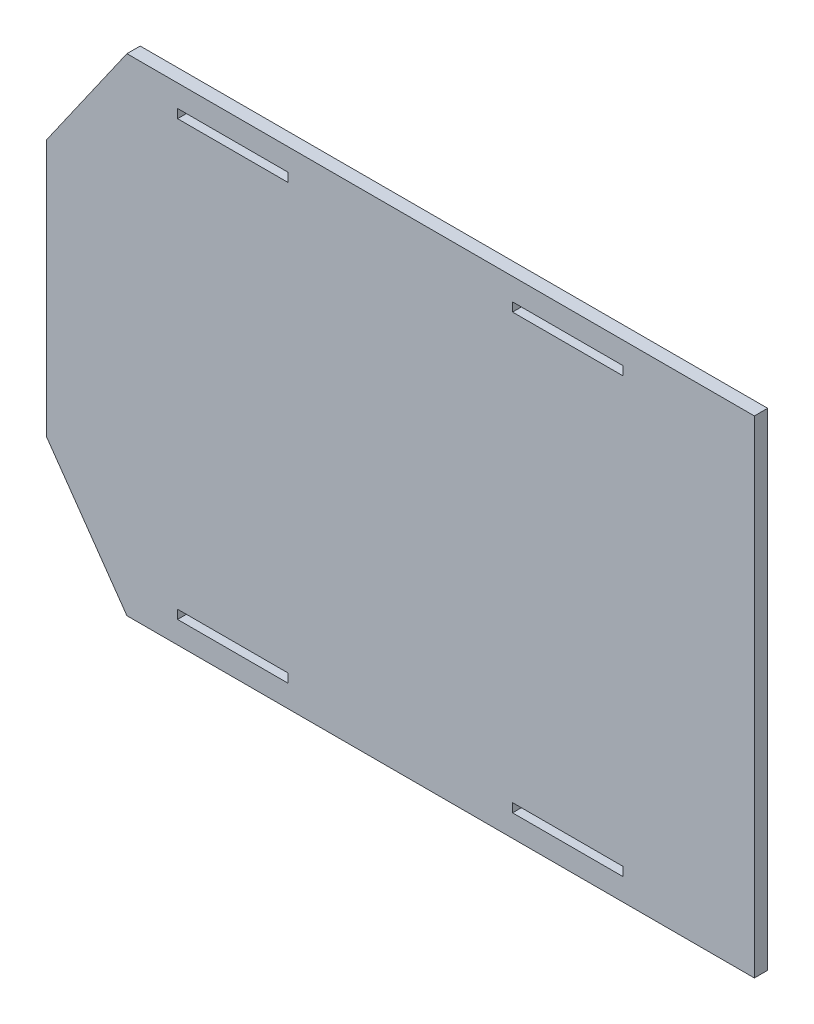
ISO-10303-21;
HEADER;
FILE_DESCRIPTION(('STEP AP214'),'2;1');
FILE_NAME('part.step','',(''),(''),'','','');
FILE_SCHEMA(('AUTOMOTIVE_DESIGN { 1 0 10303 214 1 1 1 1 }'));
ENDSEC;
DATA;
#1=APPLICATION_CONTEXT('core data for automotive mechanical design processes');
#2=APPLICATION_PROTOCOL_DEFINITION('international standard','automotive_design',2000,#1);
#3=PRODUCT_CONTEXT('',#1,'mechanical');
#4=PRODUCT('Part','Part','',(#3));
#5=PRODUCT_RELATED_PRODUCT_CATEGORY('part','',(#4));
#6=PRODUCT_DEFINITION_FORMATION('','',#4);
#7=PRODUCT_DEFINITION_CONTEXT('part definition',#1,'design');
#8=PRODUCT_DEFINITION('design','',#6,#7);
#9=PRODUCT_DEFINITION_SHAPE('','',#8);
#10=(LENGTH_UNIT() NAMED_UNIT(*) SI_UNIT(.MILLI.,.METRE.));
#11=(NAMED_UNIT(*) PLANE_ANGLE_UNIT() SI_UNIT($,.RADIAN.));
#12=(NAMED_UNIT(*) SI_UNIT($,.STERADIAN.) SOLID_ANGLE_UNIT());
#13=UNCERTAINTY_MEASURE_WITH_UNIT(LENGTH_MEASURE(1.E-05),#10,'distance_accuracy_value','');
#14=(GEOMETRIC_REPRESENTATION_CONTEXT(3) GLOBAL_UNCERTAINTY_ASSIGNED_CONTEXT((#13)) GLOBAL_UNIT_ASSIGNED_CONTEXT((#10,
#11,#12)) REPRESENTATION_CONTEXT('',''));
#15=CARTESIAN_POINT('',(0.,0.,0.));
#16=DIRECTION('',(0.,0.,1.));
#17=DIRECTION('',(1.,0.,0.));
#18=AXIS2_PLACEMENT_3D('',#15,#16,#17);
#19=CARTESIAN_POINT('',(0.,0.,6.));
#20=DIRECTION('',(0.,0.,-1.));
#21=DIRECTION('',(-1.,0.,0.));
#22=AXIS2_PLACEMENT_3D('',#19,#20,#21);
#23=PLANE('',#22);
#24=DIRECTION('',(0.,1.,0.));
#25=VECTOR('',#24,1.);
#26=CARTESIAN_POINT('',(59.2999999999999,9.99999999999998,6.));
#27=LINE('',#26,#25);
#28=CARTESIAN_POINT('',(59.2999999999999,9.99999999999998,6.));
#29=VERTEX_POINT('',#28);
#30=CARTESIAN_POINT('',(59.2999999999999,14.,6.));
#31=VERTEX_POINT('',#30);
#32=EDGE_CURVE('E338',#29,#31,#27,.T.);
#33=ORIENTED_EDGE('',*,*,#32,.T.);
#34=DIRECTION('',(1.,0.,0.));
#35=VECTOR('',#34,1.);
#36=CARTESIAN_POINT('',(59.2999999999999,14.,6.));
#37=LINE('',#36,#35);
#38=CARTESIAN_POINT('',(109.3,14.,6.));
#39=VERTEX_POINT('',#38);
#40=EDGE_CURVE('E325',#31,#39,#37,.T.);
#41=ORIENTED_EDGE('',*,*,#40,.T.);
#42=DIRECTION('',(0.,-1.,0.));
#43=VECTOR('',#42,1.);
#44=CARTESIAN_POINT('',(109.3,9.99999999999998,6.));
#45=LINE('',#44,#43);
#46=CARTESIAN_POINT('',(109.3,9.99999999999998,6.));
#47=VERTEX_POINT('',#46);
#48=EDGE_CURVE('E332',#39,#47,#45,.T.);
#49=ORIENTED_EDGE('',*,*,#48,.T.);
#50=DIRECTION('',(-1.,0.,0.));
#51=VECTOR('',#50,1.);
#52=CARTESIAN_POINT('',(59.2999999999999,9.99999999999998,6.));
#53=LINE('',#52,#51);
#54=EDGE_CURVE('E335',#47,#29,#53,.T.);
#55=ORIENTED_EDGE('',*,*,#54,.T.);
#56=EDGE_LOOP('',(#33,#41,#49,#55));
#57=FACE_BOUND('',#56,.T.);
#58=DIRECTION('',(-1.,0.,0.));
#59=VECTOR('',#58,1.);
#60=CARTESIAN_POINT('',(260.7,14.,6.));
#61=LINE('',#60,#59);
#62=CARTESIAN_POINT('',(260.7,14.,6.));
#63=VERTEX_POINT('',#62);
#64=CARTESIAN_POINT('',(210.7,14.,6.));
#65=VERTEX_POINT('',#64);
#66=EDGE_CURVE('E303',#63,#65,#61,.T.);
#67=ORIENTED_EDGE('',*,*,#66,.F.);
#68=DIRECTION('',(0.,1.,0.));
#69=VECTOR('',#68,1.);
#70=CARTESIAN_POINT('',(260.7,9.99999999999998,6.));
#71=LINE('',#70,#69);
#72=CARTESIAN_POINT('',(260.7,9.99999999999998,6.));
#73=VERTEX_POINT('',#72);
#74=EDGE_CURVE('E306',#73,#63,#71,.T.);
#75=ORIENTED_EDGE('',*,*,#74,.F.);
#76=DIRECTION('',(1.,0.,0.));
#77=VECTOR('',#76,1.);
#78=CARTESIAN_POINT('',(260.7,9.99999999999998,6.));
#79=LINE('',#78,#77);
#80=CARTESIAN_POINT('',(210.7,9.99999999999998,6.));
#81=VERTEX_POINT('',#80);
#82=EDGE_CURVE('E293',#81,#73,#79,.T.);
#83=ORIENTED_EDGE('',*,*,#82,.F.);
#84=DIRECTION('',(0.,-1.,0.));
#85=VECTOR('',#84,1.);
#86=CARTESIAN_POINT('',(210.7,9.99999999999998,6.));
#87=LINE('',#86,#85);
#88=EDGE_CURVE('E300',#65,#81,#87,.T.);
#89=ORIENTED_EDGE('',*,*,#88,.F.);
#90=EDGE_LOOP('',(#67,#75,#83,#89));
#91=FACE_BOUND('',#90,.T.);
#92=DIRECTION('',(1.,0.,0.));
#93=VECTOR('',#92,1.);
#94=CARTESIAN_POINT('',(59.2999999999999,206.,6.));
#95=LINE('',#94,#93);
#96=CARTESIAN_POINT('',(59.2999999999999,206.,6.));
#97=VERTEX_POINT('',#96);
#98=CARTESIAN_POINT('',(109.3,206.,6.));
#99=VERTEX_POINT('',#98);
#100=EDGE_CURVE('E239',#97,#99,#95,.T.);
#101=ORIENTED_EDGE('',*,*,#100,.F.);
#102=DIRECTION('',(0.,-1.,0.));
#103=VECTOR('',#102,1.);
#104=CARTESIAN_POINT('',(59.2999999999999,210.,6.));
#105=LINE('',#104,#103);
#106=CARTESIAN_POINT('',(59.2999999999999,210.,6.));
#107=VERTEX_POINT('',#106);
#108=EDGE_CURVE('E242',#107,#97,#105,.T.);
#109=ORIENTED_EDGE('',*,*,#108,.F.);
#110=DIRECTION('',(-1.,0.,0.));
#111=VECTOR('',#110,1.);
#112=CARTESIAN_POINT('',(59.2999999999999,210.,6.));
#113=LINE('',#112,#111);
#114=CARTESIAN_POINT('',(109.3,210.,6.));
#115=VERTEX_POINT('',#114);
#116=EDGE_CURVE('E229',#115,#107,#113,.T.);
#117=ORIENTED_EDGE('',*,*,#116,.F.);
#118=DIRECTION('',(0.,1.,0.));
#119=VECTOR('',#118,1.);
#120=CARTESIAN_POINT('',(109.3,210.,6.));
#121=LINE('',#120,#119);
#122=EDGE_CURVE('E236',#99,#115,#121,.T.);
#123=ORIENTED_EDGE('',*,*,#122,.F.);
#124=EDGE_LOOP('',(#101,#109,#117,#123));
#125=FACE_BOUND('',#124,.T.);
#126=DIRECTION('',(0.,-1.,0.));
#127=VECTOR('',#126,1.);
#128=CARTESIAN_POINT('',(260.7,210.,6.));
#129=LINE('',#128,#127);
#130=CARTESIAN_POINT('',(260.7,210.,6.));
#131=VERTEX_POINT('',#130);
#132=CARTESIAN_POINT('',(260.7,206.,6.));
#133=VERTEX_POINT('',#132);
#134=EDGE_CURVE('E274',#131,#133,#129,.T.);
#135=ORIENTED_EDGE('',*,*,#134,.T.);
#136=DIRECTION('',(-1.,0.,0.));
#137=VECTOR('',#136,1.);
#138=CARTESIAN_POINT('',(260.7,206.,6.));
#139=LINE('',#138,#137);
#140=CARTESIAN_POINT('',(210.7,206.,6.));
#141=VERTEX_POINT('',#140);
#142=EDGE_CURVE('E261',#133,#141,#139,.T.);
#143=ORIENTED_EDGE('',*,*,#142,.T.);
#144=DIRECTION('',(0.,1.,0.));
#145=VECTOR('',#144,1.);
#146=CARTESIAN_POINT('',(210.7,210.,6.));
#147=LINE('',#146,#145);
#148=CARTESIAN_POINT('',(210.7,210.,6.));
#149=VERTEX_POINT('',#148);
#150=EDGE_CURVE('E268',#141,#149,#147,.T.);
#151=ORIENTED_EDGE('',*,*,#150,.T.);
#152=DIRECTION('',(1.,0.,0.));
#153=VECTOR('',#152,1.);
#154=CARTESIAN_POINT('',(260.7,210.,6.));
#155=LINE('',#154,#153);
#156=EDGE_CURVE('E271',#149,#131,#155,.T.);
#157=ORIENTED_EDGE('',*,*,#156,.T.);
#158=EDGE_LOOP('',(#135,#143,#151,#157));
#159=FACE_BOUND('',#158,.T.);
#160=DIRECTION('',(-0.57357643635105,-0.819152044288989,0.));
#161=VECTOR('',#160,1.);
#162=CARTESIAN_POINT('',(0.,168.,6.));
#163=LINE('',#162,#161);
#164=CARTESIAN_POINT('',(36.4107919869053,220.,6.));
#165=VERTEX_POINT('',#164);
#166=CARTESIAN_POINT('',(0.,168.,6.));
#167=VERTEX_POINT('',#166);
#168=EDGE_CURVE('E48',#165,#167,#163,.T.);
#169=ORIENTED_EDGE('',*,*,#168,.T.);
#170=DIRECTION('',(0.,-1.,0.));
#171=VECTOR('',#170,1.);
#172=CARTESIAN_POINT('',(0.,0.,6.));
#173=LINE('',#172,#171);
#174=CARTESIAN_POINT('',(0.,52.,6.));
#175=VERTEX_POINT('',#174);
#176=EDGE_CURVE('E195',#167,#175,#173,.T.);
#177=ORIENTED_EDGE('',*,*,#176,.T.);
#178=DIRECTION('',(-0.57357643635105,0.819152044288989,0.));
#179=VECTOR('',#178,1.);
#180=CARTESIAN_POINT('',(0.,52.,6.));
#181=LINE('',#180,#179);
#182=CARTESIAN_POINT('',(36.4107919869053,0.,6.));
#183=VERTEX_POINT('',#182);
#184=EDGE_CURVE('E352',#183,#175,#181,.T.);
#185=ORIENTED_EDGE('',*,*,#184,.F.);
#186=DIRECTION('',(1.,0.,0.));
#187=VECTOR('',#186,1.);
#188=CARTESIAN_POINT('',(0.,0.,6.));
#189=LINE('',#188,#187);
#190=CARTESIAN_POINT('',(320.,0.,6.));
#191=VERTEX_POINT('',#190);
#192=EDGE_CURVE('E220',#183,#191,#189,.T.);
#193=ORIENTED_EDGE('',*,*,#192,.T.);
#194=DIRECTION('',(0.,1.,0.));
#195=VECTOR('',#194,1.);
#196=CARTESIAN_POINT('',(320.,0.,6.));
#197=LINE('',#196,#195);
#198=CARTESIAN_POINT('',(320.,220.,6.));
#199=VERTEX_POINT('',#198);
#200=EDGE_CURVE('E218',#191,#199,#197,.T.);
#201=ORIENTED_EDGE('',*,*,#200,.T.);
#202=DIRECTION('',(-1.,0.,0.));
#203=VECTOR('',#202,1.);
#204=CARTESIAN_POINT('',(0.,220.,6.));
#205=LINE('',#204,#203);
#206=EDGE_CURVE('E208',#199,#165,#205,.T.);
#207=ORIENTED_EDGE('',*,*,#206,.T.);
#208=EDGE_LOOP('',(#169,#177,#185,#193,#201,#207));
#209=FACE_BOUND('',#208,.T.);
#210=ADVANCED_FACE('F33',(#57,#91,#125,#159,#209),#23,.F.);
#211=CARTESIAN_POINT('',(0.,0.,0.));
#212=DIRECTION('',(0.,0.,-1.));
#213=DIRECTION('',(-1.,0.,0.));
#214=AXIS2_PLACEMENT_3D('',#211,#212,#213);
#215=PLANE('',#214);
#216=DIRECTION('',(0.,1.,0.));
#217=VECTOR('',#216,1.);
#218=CARTESIAN_POINT('',(260.7,9.99999999999998,0.));
#219=LINE('',#218,#217);
#220=CARTESIAN_POINT('',(260.7,9.99999999999998,0.));
#221=VERTEX_POINT('',#220);
#222=CARTESIAN_POINT('',(260.7,14.,0.));
#223=VERTEX_POINT('',#222);
#224=EDGE_CURVE('E308',#221,#223,#219,.T.);
#225=ORIENTED_EDGE('',*,*,#224,.T.);
#226=DIRECTION('',(-1.,0.,0.));
#227=VECTOR('',#226,1.);
#228=CARTESIAN_POINT('',(260.7,14.,0.));
#229=LINE('',#228,#227);
#230=CARTESIAN_POINT('',(210.7,14.,0.));
#231=VERTEX_POINT('',#230);
#232=EDGE_CURVE('E285',#223,#231,#229,.T.);
#233=ORIENTED_EDGE('',*,*,#232,.T.);
#234=DIRECTION('',(0.,-1.,0.));
#235=VECTOR('',#234,1.);
#236=CARTESIAN_POINT('',(210.7,9.99999999999998,0.));
#237=LINE('',#236,#235);
#238=CARTESIAN_POINT('',(210.7,9.99999999999998,0.));
#239=VERTEX_POINT('',#238);
#240=EDGE_CURVE('E314',#231,#239,#237,.T.);
#241=ORIENTED_EDGE('',*,*,#240,.T.);
#242=DIRECTION('',(1.,0.,0.));
#243=VECTOR('',#242,1.);
#244=CARTESIAN_POINT('',(260.7,9.99999999999998,0.));
#245=LINE('',#244,#243);
#246=EDGE_CURVE('E311',#239,#221,#245,.T.);
#247=ORIENTED_EDGE('',*,*,#246,.T.);
#248=EDGE_LOOP('',(#225,#233,#241,#247));
#249=FACE_BOUND('',#248,.T.);
#250=DIRECTION('',(0.,-1.,0.));
#251=VECTOR('',#250,1.);
#252=CARTESIAN_POINT('',(59.2999999999999,210.,0.));
#253=LINE('',#252,#251);
#254=CARTESIAN_POINT('',(59.2999999999999,210.,0.));
#255=VERTEX_POINT('',#254);
#256=CARTESIAN_POINT('',(59.2999999999999,206.,0.));
#257=VERTEX_POINT('',#256);
#258=EDGE_CURVE('E244',#255,#257,#253,.T.);
#259=ORIENTED_EDGE('',*,*,#258,.T.);
#260=DIRECTION('',(1.,0.,0.));
#261=VECTOR('',#260,1.);
#262=CARTESIAN_POINT('',(59.2999999999999,206.,0.));
#263=LINE('',#262,#261);
#264=CARTESIAN_POINT('',(109.3,206.,0.));
#265=VERTEX_POINT('',#264);
#266=EDGE_CURVE('E200',#257,#265,#263,.T.);
#267=ORIENTED_EDGE('',*,*,#266,.T.);
#268=DIRECTION('',(0.,1.,0.));
#269=VECTOR('',#268,1.);
#270=CARTESIAN_POINT('',(109.3,210.,0.));
#271=LINE('',#270,#269);
#272=CARTESIAN_POINT('',(109.3,210.,0.));
#273=VERTEX_POINT('',#272);
#274=EDGE_CURVE('E250',#265,#273,#271,.T.);
#275=ORIENTED_EDGE('',*,*,#274,.T.);
#276=DIRECTION('',(-1.,0.,0.));
#277=VECTOR('',#276,1.);
#278=CARTESIAN_POINT('',(59.2999999999999,210.,0.));
#279=LINE('',#278,#277);
#280=EDGE_CURVE('E247',#273,#255,#279,.T.);
#281=ORIENTED_EDGE('',*,*,#280,.T.);
#282=EDGE_LOOP('',(#259,#267,#275,#281));
#283=FACE_BOUND('',#282,.T.);
#284=DIRECTION('',(-1.,0.,0.));
#285=VECTOR('',#284,1.);
#286=CARTESIAN_POINT('',(260.7,206.,0.));
#287=LINE('',#286,#285);
#288=CARTESIAN_POINT('',(260.7,206.,0.));
#289=VERTEX_POINT('',#288);
#290=CARTESIAN_POINT('',(210.7,206.,0.));
#291=VERTEX_POINT('',#290);
#292=EDGE_CURVE('E280',#289,#291,#287,.T.);
#293=ORIENTED_EDGE('',*,*,#292,.F.);
#294=DIRECTION('',(0.,-1.,0.));
#295=VECTOR('',#294,1.);
#296=CARTESIAN_POINT('',(260.7,210.,0.));
#297=LINE('',#296,#295);
#298=CARTESIAN_POINT('',(260.7,210.,0.));
#299=VERTEX_POINT('',#298);
#300=EDGE_CURVE('E277',#299,#289,#297,.T.);
#301=ORIENTED_EDGE('',*,*,#300,.F.);
#302=DIRECTION('',(1.,0.,0.));
#303=VECTOR('',#302,1.);
#304=CARTESIAN_POINT('',(260.7,210.,0.));
#305=LINE('',#304,#303);
#306=CARTESIAN_POINT('',(210.7,210.,0.));
#307=VERTEX_POINT('',#306);
#308=EDGE_CURVE('E253',#307,#299,#305,.T.);
#309=ORIENTED_EDGE('',*,*,#308,.F.);
#310=DIRECTION('',(0.,1.,0.));
#311=VECTOR('',#310,1.);
#312=CARTESIAN_POINT('',(210.7,210.,0.));
#313=LINE('',#312,#311);
#314=EDGE_CURVE('E283',#291,#307,#313,.T.);
#315=ORIENTED_EDGE('',*,*,#314,.F.);
#316=EDGE_LOOP('',(#293,#301,#309,#315));
#317=FACE_BOUND('',#316,.T.);
#318=DIRECTION('',(1.,0.,0.));
#319=VECTOR('',#318,1.);
#320=CARTESIAN_POINT('',(59.2999999999999,14.,0.));
#321=LINE('',#320,#319);
#322=CARTESIAN_POINT('',(59.2999999999999,14.,0.));
#323=VERTEX_POINT('',#322);
#324=CARTESIAN_POINT('',(109.3,14.,0.));
#325=VERTEX_POINT('',#324);
#326=EDGE_CURVE('E344',#323,#325,#321,.T.);
#327=ORIENTED_EDGE('',*,*,#326,.F.);
#328=DIRECTION('',(0.,1.,0.));
#329=VECTOR('',#328,1.);
#330=CARTESIAN_POINT('',(59.2999999999999,9.99999999999998,0.));
#331=LINE('',#330,#329);
#332=CARTESIAN_POINT('',(59.2999999999999,9.99999999999998,0.));
#333=VERTEX_POINT('',#332);
#334=EDGE_CURVE('E341',#333,#323,#331,.T.);
#335=ORIENTED_EDGE('',*,*,#334,.F.);
#336=DIRECTION('',(-1.,0.,0.));
#337=VECTOR('',#336,1.);
#338=CARTESIAN_POINT('',(59.2999999999999,9.99999999999998,0.));
#339=LINE('',#338,#337);
#340=CARTESIAN_POINT('',(109.3,9.99999999999998,0.));
#341=VERTEX_POINT('',#340);
#342=EDGE_CURVE('E317',#341,#333,#339,.T.);
#343=ORIENTED_EDGE('',*,*,#342,.F.);
#344=DIRECTION('',(0.,-1.,0.));
#345=VECTOR('',#344,1.);
#346=CARTESIAN_POINT('',(109.3,9.99999999999998,0.));
#347=LINE('',#346,#345);
#348=EDGE_CURVE('E347',#325,#341,#347,.T.);
#349=ORIENTED_EDGE('',*,*,#348,.F.);
#350=EDGE_LOOP('',(#327,#335,#343,#349));
#351=FACE_BOUND('',#350,.T.);
#352=DIRECTION('',(0.,-1.,0.));
#353=VECTOR('',#352,1.);
#354=CARTESIAN_POINT('',(0.,0.,0.));
#355=LINE('',#354,#353);
#356=CARTESIAN_POINT('',(0.,168.,0.));
#357=VERTEX_POINT('',#356);
#358=CARTESIAN_POINT('',(0.,52.,0.));
#359=VERTEX_POINT('',#358);
#360=EDGE_CURVE('E194',#357,#359,#355,.T.);
#361=ORIENTED_EDGE('',*,*,#360,.F.);
#362=DIRECTION('',(-0.57357643635105,-0.819152044288989,0.));
#363=VECTOR('',#362,1.);
#364=CARTESIAN_POINT('',(0.,168.,0.));
#365=LINE('',#364,#363);
#366=CARTESIAN_POINT('',(36.4107919869053,220.,0.));
#367=VERTEX_POINT('',#366);
#368=EDGE_CURVE('E181',#367,#357,#365,.T.);
#369=ORIENTED_EDGE('',*,*,#368,.F.);
#370=DIRECTION('',(-1.,0.,0.));
#371=VECTOR('',#370,1.);
#372=CARTESIAN_POINT('',(0.,220.,0.));
#373=LINE('',#372,#371);
#374=CARTESIAN_POINT('',(320.,220.,0.));
#375=VERTEX_POINT('',#374);
#376=EDGE_CURVE('E212',#375,#367,#373,.T.);
#377=ORIENTED_EDGE('',*,*,#376,.F.);
#378=DIRECTION('',(0.,1.,0.));
#379=VECTOR('',#378,1.);
#380=CARTESIAN_POINT('',(320.,0.,0.));
#381=LINE('',#380,#379);
#382=CARTESIAN_POINT('',(320.,0.,0.));
#383=VERTEX_POINT('',#382);
#384=EDGE_CURVE('E202',#383,#375,#381,.T.);
#385=ORIENTED_EDGE('',*,*,#384,.F.);
#386=DIRECTION('',(1.,0.,0.));
#387=VECTOR('',#386,1.);
#388=CARTESIAN_POINT('',(0.,0.,0.));
#389=LINE('',#388,#387);
#390=CARTESIAN_POINT('',(36.4107919869053,0.,0.));
#391=VERTEX_POINT('',#390);
#392=EDGE_CURVE('E199',#391,#383,#389,.T.);
#393=ORIENTED_EDGE('',*,*,#392,.F.);
#394=DIRECTION('',(-0.57357643635105,0.819152044288989,0.));
#395=VECTOR('',#394,1.);
#396=CARTESIAN_POINT('',(0.,52.,0.));
#397=LINE('',#396,#395);
#398=EDGE_CURVE('E56',#391,#359,#397,.T.);
#399=ORIENTED_EDGE('',*,*,#398,.T.);
#400=EDGE_LOOP('',(#361,#369,#377,#385,#393,#399));
#401=FACE_BOUND('',#400,.T.);
#402=ADVANCED_FACE('F197',(#249,#283,#317,#351,#401),#215,.T.);
#403=CARTESIAN_POINT('',(0.,0.,6.));
#404=DIRECTION('',(1.,0.,0.));
#405=DIRECTION('',(0.,0.,-1.));
#406=AXIS2_PLACEMENT_3D('',#403,#404,#405);
#407=PLANE('',#406);
#408=DIRECTION('',(0.,0.,1.));
#409=VECTOR('',#408,1.);
#410=CARTESIAN_POINT('',(0.,168.,-0.00100000000000013));
#411=LINE('',#410,#409);
#412=EDGE_CURVE('E184',#357,#167,#411,.T.);
#413=ORIENTED_EDGE('',*,*,#412,.F.);
#414=ORIENTED_EDGE('',*,*,#360,.T.);
#415=DIRECTION('',(0.,0.,1.));
#416=VECTOR('',#415,1.);
#417=CARTESIAN_POINT('',(0.,52.,-0.00100000000000013));
#418=LINE('',#417,#416);
#419=EDGE_CURVE('E349',#359,#175,#418,.T.);
#420=ORIENTED_EDGE('',*,*,#419,.T.);
#421=ORIENTED_EDGE('',*,*,#176,.F.);
#422=EDGE_LOOP('',(#413,#414,#420,#421));
#423=FACE_BOUND('',#422,.T.);
#424=ADVANCED_FACE('F35',(#423),#407,.F.);
#425=CARTESIAN_POINT('',(0.,220.,6.));
#426=DIRECTION('',(0.,-1.,0.));
#427=DIRECTION('',(0.,0.,-1.));
#428=AXIS2_PLACEMENT_3D('',#425,#426,#427);
#429=PLANE('',#428);
#430=DIRECTION('',(0.,0.,1.));
#431=VECTOR('',#430,1.);
#432=CARTESIAN_POINT('',(36.4107919869053,220.,-0.00100000000000013));
#433=LINE('',#432,#431);
#434=EDGE_CURVE('E185',#367,#165,#433,.T.);
#435=ORIENTED_EDGE('',*,*,#434,.T.);
#436=ORIENTED_EDGE('',*,*,#206,.F.);
#437=DIRECTION('',(0.,0.,-1.));
#438=VECTOR('',#437,1.);
#439=CARTESIAN_POINT('',(320.,220.,6.));
#440=LINE('',#439,#438);
#441=EDGE_CURVE('E41',#199,#375,#440,.T.);
#442=ORIENTED_EDGE('',*,*,#441,.T.);
#443=ORIENTED_EDGE('',*,*,#376,.T.);
#444=EDGE_LOOP('',(#435,#436,#442,#443));
#445=FACE_BOUND('',#444,.T.);
#446=ADVANCED_FACE('F367',(#445),#429,.F.);
#447=CARTESIAN_POINT('',(0.,0.,6.));
#448=DIRECTION('',(0.,1.,0.));
#449=DIRECTION('',(0.,0.,1.));
#450=AXIS2_PLACEMENT_3D('',#447,#448,#449);
#451=PLANE('',#450);
#452=ORIENTED_EDGE('',*,*,#192,.F.);
#453=DIRECTION('',(0.,0.,1.));
#454=VECTOR('',#453,1.);
#455=CARTESIAN_POINT('',(36.4107919869053,0.,-0.00100000000000013));
#456=LINE('',#455,#454);
#457=EDGE_CURVE('E350',#391,#183,#456,.T.);
#458=ORIENTED_EDGE('',*,*,#457,.F.);
#459=ORIENTED_EDGE('',*,*,#392,.T.);
#460=DIRECTION('',(0.,0.,-1.));
#461=VECTOR('',#460,1.);
#462=CARTESIAN_POINT('',(320.,0.,6.));
#463=LINE('',#462,#461);
#464=EDGE_CURVE('E11',#191,#383,#463,.T.);
#465=ORIENTED_EDGE('',*,*,#464,.F.);
#466=EDGE_LOOP('',(#452,#458,#459,#465));
#467=FACE_BOUND('',#466,.T.);
#468=ADVANCED_FACE('F362',(#467),#451,.F.);
#469=CARTESIAN_POINT('',(320.,0.,6.));
#470=DIRECTION('',(-1.,0.,0.));
#471=DIRECTION('',(0.,0.,1.));
#472=AXIS2_PLACEMENT_3D('',#469,#470,#471);
#473=PLANE('',#472);
#474=ORIENTED_EDGE('',*,*,#384,.T.);
#475=ORIENTED_EDGE('',*,*,#441,.F.);
#476=ORIENTED_EDGE('',*,*,#200,.F.);
#477=ORIENTED_EDGE('',*,*,#464,.T.);
#478=EDGE_LOOP('',(#474,#475,#476,#477));
#479=FACE_BOUND('',#478,.T.);
#480=ADVANCED_FACE('F366',(#479),#473,.F.);
#481=CARTESIAN_POINT('',(59.2999999999999,210.,-0.00100000000000013));
#482=DIRECTION('',(-1.,0.,0.));
#483=DIRECTION('',(0.,0.,1.));
#484=AXIS2_PLACEMENT_3D('',#481,#482,#483);
#485=PLANE('',#484);
#486=DIRECTION('',(0.,0.,1.));
#487=VECTOR('',#486,1.);
#488=CARTESIAN_POINT('',(59.2999999999999,210.,-0.00100000000000013));
#489=LINE('',#488,#487);
#490=EDGE_CURVE('E205',#255,#107,#489,.T.);
#491=ORIENTED_EDGE('',*,*,#490,.T.);
#492=ORIENTED_EDGE('',*,*,#108,.T.);
#493=DIRECTION('',(0.,0.,1.));
#494=VECTOR('',#493,1.);
#495=CARTESIAN_POINT('',(59.2999999999999,206.,-0.00100000000000013));
#496=LINE('',#495,#494);
#497=EDGE_CURVE('E225',#257,#97,#496,.T.);
#498=ORIENTED_EDGE('',*,*,#497,.F.);
#499=ORIENTED_EDGE('',*,*,#258,.F.);
#500=EDGE_LOOP('',(#491,#492,#498,#499));
#501=FACE_BOUND('',#500,.T.);
#502=ADVANCED_FACE('F385',(#501),#485,.F.);
#503=CARTESIAN_POINT('',(59.2999999999999,210.,-0.00100000000000013));
#504=DIRECTION('',(0.,1.,0.));
#505=DIRECTION('',(0.,0.,1.));
#506=AXIS2_PLACEMENT_3D('',#503,#504,#505);
#507=PLANE('',#506);
#508=DIRECTION('',(0.,0.,1.));
#509=VECTOR('',#508,1.);
#510=CARTESIAN_POINT('',(109.3,210.,-0.00100000000000013));
#511=LINE('',#510,#509);
#512=EDGE_CURVE('E231',#273,#115,#511,.T.);
#513=ORIENTED_EDGE('',*,*,#512,.T.);
#514=ORIENTED_EDGE('',*,*,#116,.T.);
#515=ORIENTED_EDGE('',*,*,#490,.F.);
#516=ORIENTED_EDGE('',*,*,#280,.F.);
#517=EDGE_LOOP('',(#513,#514,#515,#516));
#518=FACE_BOUND('',#517,.T.);
#519=ADVANCED_FACE('F388',(#518),#507,.F.);
#520=CARTESIAN_POINT('',(109.3,210.,-0.00100000000000013));
#521=DIRECTION('',(1.,0.,0.));
#522=DIRECTION('',(0.,0.,-1.));
#523=AXIS2_PLACEMENT_3D('',#520,#521,#522);
#524=PLANE('',#523);
#525=DIRECTION('',(0.,0.,1.));
#526=VECTOR('',#525,1.);
#527=CARTESIAN_POINT('',(109.3,206.,-0.00100000000000013));
#528=LINE('',#527,#526);
#529=EDGE_CURVE('E228',#265,#99,#528,.T.);
#530=ORIENTED_EDGE('',*,*,#529,.T.);
#531=ORIENTED_EDGE('',*,*,#122,.T.);
#532=ORIENTED_EDGE('',*,*,#512,.F.);
#533=ORIENTED_EDGE('',*,*,#274,.F.);
#534=EDGE_LOOP('',(#530,#531,#532,#533));
#535=FACE_BOUND('',#534,.T.);
#536=ADVANCED_FACE('F394',(#535),#524,.F.);
#537=CARTESIAN_POINT('',(59.2999999999999,206.,-0.00100000000000013));
#538=DIRECTION('',(0.,-1.,0.));
#539=DIRECTION('',(0.,0.,-1.));
#540=AXIS2_PLACEMENT_3D('',#537,#538,#539);
#541=PLANE('',#540);
#542=ORIENTED_EDGE('',*,*,#497,.T.);
#543=ORIENTED_EDGE('',*,*,#100,.T.);
#544=ORIENTED_EDGE('',*,*,#529,.F.);
#545=ORIENTED_EDGE('',*,*,#266,.F.);
#546=EDGE_LOOP('',(#542,#543,#544,#545));
#547=FACE_BOUND('',#546,.T.);
#548=ADVANCED_FACE('F390',(#547),#541,.F.);
#549=CARTESIAN_POINT('',(260.7,210.,-0.00100000000000013));
#550=DIRECTION('',(-1.,0.,0.));
#551=DIRECTION('',(0.,0.,1.));
#552=AXIS2_PLACEMENT_3D('',#549,#550,#551);
#553=PLANE('',#552);
#554=ORIENTED_EDGE('',*,*,#300,.T.);
#555=DIRECTION('',(0.,0.,1.));
#556=VECTOR('',#555,1.);
#557=CARTESIAN_POINT('',(260.7,206.,-0.00100000000000013));
#558=LINE('',#557,#556);
#559=EDGE_CURVE('E256',#289,#133,#558,.T.);
#560=ORIENTED_EDGE('',*,*,#559,.T.);
#561=ORIENTED_EDGE('',*,*,#134,.F.);
#562=DIRECTION('',(0.,0.,1.));
#563=VECTOR('',#562,1.);
#564=CARTESIAN_POINT('',(260.7,210.,-0.00100000000000013));
#565=LINE('',#564,#563);
#566=EDGE_CURVE('E257',#299,#131,#565,.T.);
#567=ORIENTED_EDGE('',*,*,#566,.F.);
#568=EDGE_LOOP('',(#554,#560,#561,#567));
#569=FACE_BOUND('',#568,.T.);
#570=ADVANCED_FACE('F393',(#569),#553,.T.);
#571=CARTESIAN_POINT('',(260.7,206.,-0.00100000000000013));
#572=DIRECTION('',(0.,1.,0.));
#573=DIRECTION('',(0.,0.,1.));
#574=AXIS2_PLACEMENT_3D('',#571,#572,#573);
#575=PLANE('',#574);
#576=ORIENTED_EDGE('',*,*,#292,.T.);
#577=DIRECTION('',(0.,0.,1.));
#578=VECTOR('',#577,1.);
#579=CARTESIAN_POINT('',(210.7,206.,-0.00100000000000013));
#580=LINE('',#579,#578);
#581=EDGE_CURVE('E263',#291,#141,#580,.T.);
#582=ORIENTED_EDGE('',*,*,#581,.T.);
#583=ORIENTED_EDGE('',*,*,#142,.F.);
#584=ORIENTED_EDGE('',*,*,#559,.F.);
#585=EDGE_LOOP('',(#576,#582,#583,#584));
#586=FACE_BOUND('',#585,.T.);
#587=ADVANCED_FACE('F404',(#586),#575,.T.);
#588=CARTESIAN_POINT('',(210.7,210.,-0.00100000000000013));
#589=DIRECTION('',(1.,0.,0.));
#590=DIRECTION('',(0.,0.,-1.));
#591=AXIS2_PLACEMENT_3D('',#588,#589,#590);
#592=PLANE('',#591);
#593=ORIENTED_EDGE('',*,*,#314,.T.);
#594=DIRECTION('',(0.,0.,1.));
#595=VECTOR('',#594,1.);
#596=CARTESIAN_POINT('',(210.7,210.,-0.00100000000000013));
#597=LINE('',#596,#595);
#598=EDGE_CURVE('E260',#307,#149,#597,.T.);
#599=ORIENTED_EDGE('',*,*,#598,.T.);
#600=ORIENTED_EDGE('',*,*,#150,.F.);
#601=ORIENTED_EDGE('',*,*,#581,.F.);
#602=EDGE_LOOP('',(#593,#599,#600,#601));
#603=FACE_BOUND('',#602,.T.);
#604=ADVANCED_FACE('F410',(#603),#592,.T.);
#605=CARTESIAN_POINT('',(260.7,210.,-0.00100000000000013));
#606=DIRECTION('',(0.,-1.,0.));
#607=DIRECTION('',(0.,0.,-1.));
#608=AXIS2_PLACEMENT_3D('',#605,#606,#607);
#609=PLANE('',#608);
#610=ORIENTED_EDGE('',*,*,#308,.T.);
#611=ORIENTED_EDGE('',*,*,#566,.T.);
#612=ORIENTED_EDGE('',*,*,#156,.F.);
#613=ORIENTED_EDGE('',*,*,#598,.F.);
#614=EDGE_LOOP('',(#610,#611,#612,#613));
#615=FACE_BOUND('',#614,.T.);
#616=ADVANCED_FACE('F406',(#615),#609,.T.);
#617=CARTESIAN_POINT('',(260.7,9.99999999999998,-0.00100000000000013));
#618=DIRECTION('',(1.,0.,0.));
#619=DIRECTION('',(0.,0.,-1.));
#620=AXIS2_PLACEMENT_3D('',#617,#618,#619);
#621=PLANE('',#620);
#622=DIRECTION('',(0.,0.,1.));
#623=VECTOR('',#622,1.);
#624=CARTESIAN_POINT('',(260.7,9.99999999999998,-0.00100000000000013));
#625=LINE('',#624,#623);
#626=EDGE_CURVE('E288',#221,#73,#625,.T.);
#627=ORIENTED_EDGE('',*,*,#626,.T.);
#628=ORIENTED_EDGE('',*,*,#74,.T.);
#629=DIRECTION('',(0.,0.,1.));
#630=VECTOR('',#629,1.);
#631=CARTESIAN_POINT('',(260.7,14.,-0.00100000000000013));
#632=LINE('',#631,#630);
#633=EDGE_CURVE('E289',#223,#63,#632,.T.);
#634=ORIENTED_EDGE('',*,*,#633,.F.);
#635=ORIENTED_EDGE('',*,*,#224,.F.);
#636=EDGE_LOOP('',(#627,#628,#634,#635));
#637=FACE_BOUND('',#636,.T.);
#638=ADVANCED_FACE('F409',(#637),#621,.F.);
#639=CARTESIAN_POINT('',(260.7,9.99999999999998,-0.00100000000000013));
#640=DIRECTION('',(0.,-1.,0.));
#641=DIRECTION('',(0.,0.,-1.));
#642=AXIS2_PLACEMENT_3D('',#639,#640,#641);
#643=PLANE('',#642);
#644=DIRECTION('',(0.,0.,1.));
#645=VECTOR('',#644,1.);
#646=CARTESIAN_POINT('',(210.7,9.99999999999998,-0.00100000000000013));
#647=LINE('',#646,#645);
#648=EDGE_CURVE('E295',#239,#81,#647,.T.);
#649=ORIENTED_EDGE('',*,*,#648,.T.);
#650=ORIENTED_EDGE('',*,*,#82,.T.);
#651=ORIENTED_EDGE('',*,*,#626,.F.);
#652=ORIENTED_EDGE('',*,*,#246,.F.);
#653=EDGE_LOOP('',(#649,#650,#651,#652));
#654=FACE_BOUND('',#653,.T.);
#655=ADVANCED_FACE('F420',(#654),#643,.F.);
#656=CARTESIAN_POINT('',(210.7,9.99999999999998,-0.00100000000000013));
#657=DIRECTION('',(-1.,0.,0.));
#658=DIRECTION('',(0.,0.,1.));
#659=AXIS2_PLACEMENT_3D('',#656,#657,#658);
#660=PLANE('',#659);
#661=DIRECTION('',(0.,0.,1.));
#662=VECTOR('',#661,1.);
#663=CARTESIAN_POINT('',(210.7,14.,-0.00100000000000013));
#664=LINE('',#663,#662);
#665=EDGE_CURVE('E292',#231,#65,#664,.T.);
#666=ORIENTED_EDGE('',*,*,#665,.T.);
#667=ORIENTED_EDGE('',*,*,#88,.T.);
#668=ORIENTED_EDGE('',*,*,#648,.F.);
#669=ORIENTED_EDGE('',*,*,#240,.F.);
#670=EDGE_LOOP('',(#666,#667,#668,#669));
#671=FACE_BOUND('',#670,.T.);
#672=ADVANCED_FACE('F426',(#671),#660,.F.);
#673=CARTESIAN_POINT('',(260.7,14.,-0.00100000000000013));
#674=DIRECTION('',(0.,1.,0.));
#675=DIRECTION('',(0.,0.,1.));
#676=AXIS2_PLACEMENT_3D('',#673,#674,#675);
#677=PLANE('',#676);
#678=ORIENTED_EDGE('',*,*,#633,.T.);
#679=ORIENTED_EDGE('',*,*,#66,.T.);
#680=ORIENTED_EDGE('',*,*,#665,.F.);
#681=ORIENTED_EDGE('',*,*,#232,.F.);
#682=EDGE_LOOP('',(#678,#679,#680,#681));
#683=FACE_BOUND('',#682,.T.);
#684=ADVANCED_FACE('F422',(#683),#677,.F.);
#685=CARTESIAN_POINT('',(59.2999999999999,9.99999999999998,-0.00100000000000013));
#686=DIRECTION('',(1.,0.,0.));
#687=DIRECTION('',(0.,0.,-1.));
#688=AXIS2_PLACEMENT_3D('',#685,#686,#687);
#689=PLANE('',#688);
#690=ORIENTED_EDGE('',*,*,#334,.T.);
#691=DIRECTION('',(0.,0.,1.));
#692=VECTOR('',#691,1.);
#693=CARTESIAN_POINT('',(59.2999999999999,14.,-0.00100000000000013));
#694=LINE('',#693,#692);
#695=EDGE_CURVE('E320',#323,#31,#694,.T.);
#696=ORIENTED_EDGE('',*,*,#695,.T.);
#697=ORIENTED_EDGE('',*,*,#32,.F.);
#698=DIRECTION('',(0.,0.,1.));
#699=VECTOR('',#698,1.);
#700=CARTESIAN_POINT('',(59.2999999999999,9.99999999999998,-0.00100000000000013));
#701=LINE('',#700,#699);
#702=EDGE_CURVE('E321',#333,#29,#701,.T.);
#703=ORIENTED_EDGE('',*,*,#702,.F.);
#704=EDGE_LOOP('',(#690,#696,#697,#703));
#705=FACE_BOUND('',#704,.T.);
#706=ADVANCED_FACE('F425',(#705),#689,.T.);
#707=CARTESIAN_POINT('',(59.2999999999999,14.,-0.00100000000000013));
#708=DIRECTION('',(0.,-1.,0.));
#709=DIRECTION('',(0.,0.,-1.));
#710=AXIS2_PLACEMENT_3D('',#707,#708,#709);
#711=PLANE('',#710);
#712=ORIENTED_EDGE('',*,*,#326,.T.);
#713=DIRECTION('',(0.,0.,1.));
#714=VECTOR('',#713,1.);
#715=CARTESIAN_POINT('',(109.3,14.,-0.00100000000000013));
#716=LINE('',#715,#714);
#717=EDGE_CURVE('E327',#325,#39,#716,.T.);
#718=ORIENTED_EDGE('',*,*,#717,.T.);
#719=ORIENTED_EDGE('',*,*,#40,.F.);
#720=ORIENTED_EDGE('',*,*,#695,.F.);
#721=EDGE_LOOP('',(#712,#718,#719,#720));
#722=FACE_BOUND('',#721,.T.);
#723=ADVANCED_FACE('F436',(#722),#711,.T.);
#724=CARTESIAN_POINT('',(109.3,9.99999999999998,-0.00100000000000013));
#725=DIRECTION('',(-1.,0.,0.));
#726=DIRECTION('',(0.,0.,1.));
#727=AXIS2_PLACEMENT_3D('',#724,#725,#726);
#728=PLANE('',#727);
#729=ORIENTED_EDGE('',*,*,#348,.T.);
#730=DIRECTION('',(0.,0.,1.));
#731=VECTOR('',#730,1.);
#732=CARTESIAN_POINT('',(109.3,9.99999999999998,-0.00100000000000013));
#733=LINE('',#732,#731);
#734=EDGE_CURVE('E324',#341,#47,#733,.T.);
#735=ORIENTED_EDGE('',*,*,#734,.T.);
#736=ORIENTED_EDGE('',*,*,#48,.F.);
#737=ORIENTED_EDGE('',*,*,#717,.F.);
#738=EDGE_LOOP('',(#729,#735,#736,#737));
#739=FACE_BOUND('',#738,.T.);
#740=ADVANCED_FACE('F441',(#739),#728,.T.);
#741=CARTESIAN_POINT('',(59.2999999999999,9.99999999999998,-0.00100000000000013));
#742=DIRECTION('',(0.,1.,0.));
#743=DIRECTION('',(0.,0.,1.));
#744=AXIS2_PLACEMENT_3D('',#741,#742,#743);
#745=PLANE('',#744);
#746=ORIENTED_EDGE('',*,*,#342,.T.);
#747=ORIENTED_EDGE('',*,*,#702,.T.);
#748=ORIENTED_EDGE('',*,*,#54,.F.);
#749=ORIENTED_EDGE('',*,*,#734,.F.);
#750=EDGE_LOOP('',(#746,#747,#748,#749));
#751=FACE_BOUND('',#750,.T.);
#752=ADVANCED_FACE('F438',(#751),#745,.T.);
#753=CARTESIAN_POINT('',(0.,52.,-0.00100000000000013));
#754=DIRECTION('',(0.819152044288989,0.57357643635105,0.));
#755=DIRECTION('',(-0.57357643635105,0.819152044288989,0.));
#756=AXIS2_PLACEMENT_3D('',#753,#754,#755);
#757=PLANE('',#756);
#758=ORIENTED_EDGE('',*,*,#457,.T.);
#759=ORIENTED_EDGE('',*,*,#184,.T.);
#760=ORIENTED_EDGE('',*,*,#419,.F.);
#761=ORIENTED_EDGE('',*,*,#398,.F.);
#762=EDGE_LOOP('',(#758,#759,#760,#761));
#763=FACE_BOUND('',#762,.T.);
#764=ADVANCED_FACE('F360',(#763),#757,.F.);
#765=CARTESIAN_POINT('',(0.,168.,-0.00100000000000013));
#766=DIRECTION('',(-0.819152044288989,0.57357643635105,0.));
#767=DIRECTION('',(-0.57357643635105,-0.819152044288989,0.));
#768=AXIS2_PLACEMENT_3D('',#765,#766,#767);
#769=PLANE('',#768);
#770=ORIENTED_EDGE('',*,*,#368,.T.);
#771=ORIENTED_EDGE('',*,*,#412,.T.);
#772=ORIENTED_EDGE('',*,*,#168,.F.);
#773=ORIENTED_EDGE('',*,*,#434,.F.);
#774=EDGE_LOOP('',(#770,#771,#772,#773));
#775=FACE_BOUND('',#774,.T.);
#776=ADVANCED_FACE('F183',(#775),#769,.T.);
#777=CLOSED_SHELL('',(#210,#402,#424,#446,#468,#480,#502,#519,#536,#548,#570,#587,#604,#616,
#638,#655,#672,#684,#706,#723,#740,#752,#764,#776));
#778=MANIFOLD_SOLID_BREP('B2',#777);
#779=ADVANCED_BREP_SHAPE_REPRESENTATION('',(#18,#778),#14);
#780=SHAPE_DEFINITION_REPRESENTATION(#9,#779);
ENDSEC;
END-ISO-10303-21;
